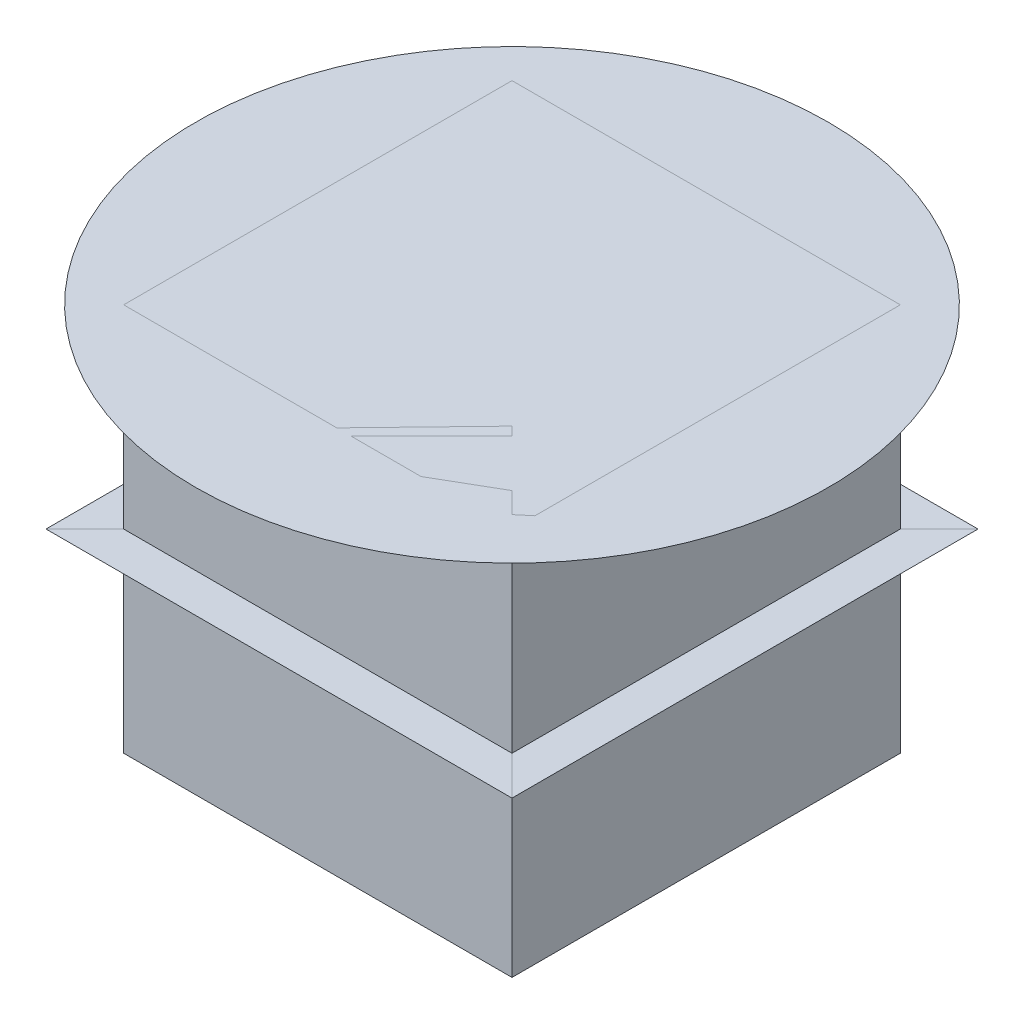
ISO-10303-21;
HEADER;
FILE_DESCRIPTION(('STEP AP214'),'2;1');
FILE_NAME('part.step','',(''),(''),'','','');
FILE_SCHEMA(('AUTOMOTIVE_DESIGN { 1 0 10303 214 1 1 1 1 }'));
ENDSEC;
DATA;
#1=APPLICATION_CONTEXT('core data for automotive mechanical design processes');
#2=APPLICATION_PROTOCOL_DEFINITION('international standard','automotive_design',2000,#1);
#3=PRODUCT_CONTEXT('',#1,'mechanical');
#4=PRODUCT('Part','Part','',(#3));
#5=PRODUCT_RELATED_PRODUCT_CATEGORY('part','',(#4));
#6=PRODUCT_DEFINITION_FORMATION('','',#4);
#7=PRODUCT_DEFINITION_CONTEXT('part definition',#1,'design');
#8=PRODUCT_DEFINITION('design','',#6,#7);
#9=PRODUCT_DEFINITION_SHAPE('','',#8);
#10=(LENGTH_UNIT() NAMED_UNIT(*) SI_UNIT(.MILLI.,.METRE.));
#11=(NAMED_UNIT(*) PLANE_ANGLE_UNIT() SI_UNIT($,.RADIAN.));
#12=(NAMED_UNIT(*) SI_UNIT($,.STERADIAN.) SOLID_ANGLE_UNIT());
#13=UNCERTAINTY_MEASURE_WITH_UNIT(LENGTH_MEASURE(1.E-05),#10,'distance_accuracy_value','');
#14=(GEOMETRIC_REPRESENTATION_CONTEXT(3) GLOBAL_UNCERTAINTY_ASSIGNED_CONTEXT((#13)) GLOBAL_UNIT_ASSIGNED_CONTEXT((#10,
#11,#12)) REPRESENTATION_CONTEXT('',''));
#15=CARTESIAN_POINT('',(0.,0.,0.));
#16=DIRECTION('',(0.,0.,1.));
#17=DIRECTION('',(1.,0.,0.));
#18=AXIS2_PLACEMENT_3D('',#15,#16,#17);
#19=CARTESIAN_POINT('',(0.,50.,0.));
#20=DIRECTION('',(0.,1.,0.));
#21=DIRECTION('',(0.,0.,1.));
#22=AXIS2_PLACEMENT_3D('',#19,#20,#21);
#23=PLANE('',#22);
#24=CARTESIAN_POINT('',(0.,50.,0.));
#25=DIRECTION('',(0.,1.,0.));
#26=DIRECTION('',(0.,0.,1.));
#27=AXIS2_PLACEMENT_3D('',#24,#25,#26);
#28=CIRCLE('',#27,81.467474192056);
#29=CARTESIAN_POINT('',(0.,50.,81.467474192056));
#30=VERTEX_POINT('',#29);
#31=EDGE_CURVE('E13',#30,#30,#28,.T.);
#32=ORIENTED_EDGE('',*,*,#31,.T.);
#33=EDGE_LOOP('',(#32));
#34=FACE_BOUND('',#33,.T.);
#35=ADVANCED_FACE('F53',(#34),#23,.T.);
#36=OPEN_SHELL('',(#35));
#37=SHELL_BASED_SURFACE_MODEL('B2',(#36));
#38=CARTESIAN_POINT('',(0.,0.,0.));
#39=DIRECTION('',(0.,1.,0.));
#40=DIRECTION('',(0.,0.,1.));
#41=AXIS2_PLACEMENT_3D('',#38,#39,#40);
#42=PLANE('',#41);
#43=DIRECTION('',(1.,0.,0.));
#44=VECTOR('',#43,1.);
#45=CARTESIAN_POINT('',(-60.,0.,60.));
#46=LINE('',#45,#44);
#47=CARTESIAN_POINT('',(-60.,0.,60.));
#48=VERTEX_POINT('',#47);
#49=CARTESIAN_POINT('',(60.,0.,60.));
#50=VERTEX_POINT('',#49);
#51=EDGE_CURVE('E86',#48,#50,#46,.T.);
#52=ORIENTED_EDGE('',*,*,#51,.T.);
#53=DIRECTION('',(-0.707106781186548,0.,-0.707106781186547));
#54=VECTOR('',#53,1.);
#55=CARTESIAN_POINT('',(60.,0.,60.));
#56=LINE('',#55,#54);
#57=CARTESIAN_POINT('',(50.,0.,50.));
#58=VERTEX_POINT('',#57);
#59=EDGE_CURVE('E51',#50,#58,#56,.T.);
#60=ORIENTED_EDGE('',*,*,#59,.T.);
#61=DIRECTION('',(-1.,0.,0.));
#62=VECTOR('',#61,1.);
#63=CARTESIAN_POINT('',(-50.,0.,50.));
#64=LINE('',#63,#62);
#65=CARTESIAN_POINT('',(-50.,0.,50.));
#66=VERTEX_POINT('',#65);
#67=EDGE_CURVE('E80',#58,#66,#64,.T.);
#68=ORIENTED_EDGE('',*,*,#67,.T.);
#69=DIRECTION('',(-0.707106781186548,0.,0.707106781186548));
#70=VECTOR('',#69,1.);
#71=CARTESIAN_POINT('',(-50.,0.,50.));
#72=LINE('',#71,#70);
#73=EDGE_CURVE('E100',#66,#48,#72,.T.);
#74=ORIENTED_EDGE('',*,*,#73,.T.);
#75=EDGE_LOOP('',(#52,#60,#68,#74));
#76=FACE_BOUND('',#75,.T.);
#77=ADVANCED_FACE('F79',(#76),#42,.T.);
#78=OPEN_SHELL('',(#77));
#79=SHELL_BASED_SURFACE_MODEL('B8',(#78));
#80=CARTESIAN_POINT('',(0.,0.,0.));
#81=DIRECTION('',(0.,1.,0.));
#82=DIRECTION('',(0.,0.,1.));
#83=AXIS2_PLACEMENT_3D('',#80,#81,#82);
#84=PLANE('',#83);
#85=DIRECTION('',(0.,0.,-1.));
#86=VECTOR('',#85,1.);
#87=CARTESIAN_POINT('',(60.,0.,60.));
#88=LINE('',#87,#86);
#89=CARTESIAN_POINT('',(60.,0.,60.));
#90=VERTEX_POINT('',#89);
#91=CARTESIAN_POINT('',(60.,0.,-60.));
#92=VERTEX_POINT('',#91);
#93=EDGE_CURVE('E139',#90,#92,#88,.T.);
#94=ORIENTED_EDGE('',*,*,#93,.T.);
#95=DIRECTION('',(-0.707106781186547,0.,0.707106781186547));
#96=VECTOR('',#95,1.);
#97=CARTESIAN_POINT('',(60.,0.,-60.));
#98=LINE('',#97,#96);
#99=CARTESIAN_POINT('',(50.,0.,-50.));
#100=VERTEX_POINT('',#99);
#101=EDGE_CURVE('E77',#92,#100,#98,.T.);
#102=ORIENTED_EDGE('',*,*,#101,.T.);
#103=DIRECTION('',(0.,0.,1.));
#104=VECTOR('',#103,1.);
#105=CARTESIAN_POINT('',(50.,0.,-50.));
#106=LINE('',#105,#104);
#107=CARTESIAN_POINT('',(50.,0.,50.));
#108=VERTEX_POINT('',#107);
#109=EDGE_CURVE('E133',#100,#108,#106,.T.);
#110=ORIENTED_EDGE('',*,*,#109,.T.);
#111=DIRECTION('',(0.707106781186547,0.,0.707106781186548));
#112=VECTOR('',#111,1.);
#113=CARTESIAN_POINT('',(50.,0.,50.));
#114=LINE('',#113,#112);
#115=EDGE_CURVE('E153',#108,#90,#114,.T.);
#116=ORIENTED_EDGE('',*,*,#115,.T.);
#117=EDGE_LOOP('',(#94,#102,#110,#116));
#118=FACE_BOUND('',#117,.T.);
#119=ADVANCED_FACE('F132',(#118),#84,.T.);
#120=OPEN_SHELL('',(#119));
#121=SHELL_BASED_SURFACE_MODEL('B45',(#120));
#122=CARTESIAN_POINT('',(0.,0.,0.));
#123=DIRECTION('',(0.,1.,0.));
#124=DIRECTION('',(0.,0.,1.));
#125=AXIS2_PLACEMENT_3D('',#122,#123,#124);
#126=PLANE('',#125);
#127=DIRECTION('',(-1.,0.,0.));
#128=VECTOR('',#127,1.);
#129=CARTESIAN_POINT('',(60.,0.,-60.));
#130=LINE('',#129,#128);
#131=CARTESIAN_POINT('',(60.,0.,-60.));
#132=VERTEX_POINT('',#131);
#133=CARTESIAN_POINT('',(-60.,0.,-60.));
#134=VERTEX_POINT('',#133);
#135=EDGE_CURVE('E192',#132,#134,#130,.T.);
#136=ORIENTED_EDGE('',*,*,#135,.T.);
#137=DIRECTION('',(0.707106781186548,0.,0.707106781186547));
#138=VECTOR('',#137,1.);
#139=CARTESIAN_POINT('',(-60.,0.,-60.));
#140=LINE('',#139,#138);
#141=CARTESIAN_POINT('',(-50.,0.,-50.));
#142=VERTEX_POINT('',#141);
#143=EDGE_CURVE('E130',#134,#142,#140,.T.);
#144=ORIENTED_EDGE('',*,*,#143,.T.);
#145=DIRECTION('',(1.,0.,0.));
#146=VECTOR('',#145,1.);
#147=CARTESIAN_POINT('',(-50.,0.,-50.));
#148=LINE('',#147,#146);
#149=CARTESIAN_POINT('',(50.,0.,-50.));
#150=VERTEX_POINT('',#149);
#151=EDGE_CURVE('E186',#142,#150,#148,.T.);
#152=ORIENTED_EDGE('',*,*,#151,.T.);
#153=DIRECTION('',(0.707106781186547,0.,-0.707106781186548));
#154=VECTOR('',#153,1.);
#155=CARTESIAN_POINT('',(50.,0.,-50.));
#156=LINE('',#155,#154);
#157=EDGE_CURVE('E206',#150,#132,#156,.T.);
#158=ORIENTED_EDGE('',*,*,#157,.T.);
#159=EDGE_LOOP('',(#136,#144,#152,#158));
#160=FACE_BOUND('',#159,.T.);
#161=ADVANCED_FACE('F185',(#160),#126,.T.);
#162=OPEN_SHELL('',(#161));
#163=SHELL_BASED_SURFACE_MODEL('B71',(#162));
#164=CARTESIAN_POINT('',(0.,0.,0.));
#165=DIRECTION('',(0.,1.,0.));
#166=DIRECTION('',(0.,0.,1.));
#167=AXIS2_PLACEMENT_3D('',#164,#165,#166);
#168=PLANE('',#167);
#169=DIRECTION('',(0.,0.,1.));
#170=VECTOR('',#169,1.);
#171=CARTESIAN_POINT('',(-60.,0.,-60.));
#172=LINE('',#171,#170);
#173=CARTESIAN_POINT('',(-60.,0.,-60.));
#174=VERTEX_POINT('',#173);
#175=CARTESIAN_POINT('',(-60.,0.,60.));
#176=VERTEX_POINT('',#175);
#177=EDGE_CURVE('E245',#174,#176,#172,.T.);
#178=ORIENTED_EDGE('',*,*,#177,.T.);
#179=DIRECTION('',(0.707106781186548,0.,-0.707106781186548));
#180=VECTOR('',#179,1.);
#181=CARTESIAN_POINT('',(-60.,0.,60.));
#182=LINE('',#181,#180);
#183=CARTESIAN_POINT('',(-50.,0.,50.));
#184=VERTEX_POINT('',#183);
#185=EDGE_CURVE('E183',#176,#184,#182,.T.);
#186=ORIENTED_EDGE('',*,*,#185,.T.);
#187=DIRECTION('',(0.,0.,-1.));
#188=VECTOR('',#187,1.);
#189=CARTESIAN_POINT('',(-50.,0.,-50.));
#190=LINE('',#189,#188);
#191=CARTESIAN_POINT('',(-50.,0.,-50.));
#192=VERTEX_POINT('',#191);
#193=EDGE_CURVE('E239',#184,#192,#190,.T.);
#194=ORIENTED_EDGE('',*,*,#193,.T.);
#195=DIRECTION('',(-0.707106781186548,0.,-0.707106781186548));
#196=VECTOR('',#195,1.);
#197=CARTESIAN_POINT('',(-50.,0.,-50.));
#198=LINE('',#197,#196);
#199=EDGE_CURVE('E259',#192,#174,#198,.T.);
#200=ORIENTED_EDGE('',*,*,#199,.T.);
#201=EDGE_LOOP('',(#178,#186,#194,#200));
#202=FACE_BOUND('',#201,.T.);
#203=ADVANCED_FACE('F238',(#202),#168,.T.);
#204=OPEN_SHELL('',(#203));
#205=SHELL_BASED_SURFACE_MODEL('B124',(#204));
#206=CARTESIAN_POINT('',(0.,0.,0.));
#207=DIRECTION('',(0.,1.,0.));
#208=DIRECTION('',(0.,0.,1.));
#209=AXIS2_PLACEMENT_3D('',#206,#207,#208);
#210=PLANE('',#209);
#211=DIRECTION('',(0.,0.,-1.));
#212=VECTOR('',#211,1.);
#213=CARTESIAN_POINT('',(50.,0.,-50.));
#214=LINE('',#213,#212);
#215=CARTESIAN_POINT('',(50.,0.,50.));
#216=VERTEX_POINT('',#215);
#217=CARTESIAN_POINT('',(50.,0.,-50.));
#218=VERTEX_POINT('',#217);
#219=EDGE_CURVE('E299',#216,#218,#214,.T.);
#220=ORIENTED_EDGE('',*,*,#219,.T.);
#221=DIRECTION('',(-1.,0.,0.));
#222=VECTOR('',#221,1.);
#223=CARTESIAN_POINT('',(-50.,0.,-50.));
#224=LINE('',#223,#222);
#225=CARTESIAN_POINT('',(-50.,0.,-50.));
#226=VERTEX_POINT('',#225);
#227=EDGE_CURVE('E310',#218,#226,#224,.T.);
#228=ORIENTED_EDGE('',*,*,#227,.T.);
#229=DIRECTION('',(0.,0.,1.));
#230=VECTOR('',#229,1.);
#231=CARTESIAN_POINT('',(-50.,0.,-50.));
#232=LINE('',#231,#230);
#233=CARTESIAN_POINT('',(-50.,0.,50.));
#234=VERTEX_POINT('',#233);
#235=EDGE_CURVE('E295',#226,#234,#232,.T.);
#236=ORIENTED_EDGE('',*,*,#235,.T.);
#237=DIRECTION('',(1.,0.,0.));
#238=VECTOR('',#237,1.);
#239=CARTESIAN_POINT('',(-50.,0.,50.));
#240=LINE('',#239,#238);
#241=EDGE_CURVE('E236',#234,#216,#240,.T.);
#242=ORIENTED_EDGE('',*,*,#241,.T.);
#243=EDGE_LOOP('',(#220,#228,#236,#242));
#244=FACE_BOUND('',#243,.T.);
#245=ADVANCED_FACE('F290',(#244),#210,.T.);
#246=OPEN_SHELL('',(#245));
#247=SHELL_BASED_SURFACE_MODEL('B177',(#246));
#248=CARTESIAN_POINT('',(50.,50.,-50.));
#249=DIRECTION('',(-1.,0.,0.));
#250=DIRECTION('',(0.,0.,1.));
#251=AXIS2_PLACEMENT_3D('',#248,#249,#250);
#252=PLANE('',#251);
#253=DIRECTION('',(0.,0.,-1.));
#254=VECTOR('',#253,1.);
#255=CARTESIAN_POINT('',(50.,-50.,-50.));
#256=LINE('',#255,#254);
#257=CARTESIAN_POINT('',(50.,-50.,50.));
#258=VERTEX_POINT('',#257);
#259=CARTESIAN_POINT('',(50.,-50.,-50.));
#260=VERTEX_POINT('',#259);
#261=EDGE_CURVE('E396',#258,#260,#256,.T.);
#262=ORIENTED_EDGE('',*,*,#261,.T.);
#263=DIRECTION('',(0.,-1.,0.));
#264=VECTOR('',#263,1.);
#265=CARTESIAN_POINT('',(50.,50.,-50.));
#266=LINE('',#265,#264);
#267=CARTESIAN_POINT('',(50.,50.,-50.));
#268=VERTEX_POINT('',#267);
#269=EDGE_CURVE('E288',#268,#260,#266,.T.);
#270=ORIENTED_EDGE('',*,*,#269,.F.);
#271=DIRECTION('',(0.,0.,-1.));
#272=VECTOR('',#271,1.);
#273=CARTESIAN_POINT('',(50.,50.,-50.));
#274=LINE('',#273,#272);
#275=CARTESIAN_POINT('',(50.,50.,50.));
#276=VERTEX_POINT('',#275);
#277=EDGE_CURVE('E384',#276,#268,#274,.T.);
#278=ORIENTED_EDGE('',*,*,#277,.F.);
#279=DIRECTION('',(0.,-1.,0.));
#280=VECTOR('',#279,1.);
#281=CARTESIAN_POINT('',(50.,50.,50.));
#282=LINE('',#281,#280);
#283=EDGE_CURVE('E392',#276,#258,#282,.T.);
#284=ORIENTED_EDGE('',*,*,#283,.T.);
#285=EDGE_LOOP('',(#262,#270,#278,#284));
#286=FACE_BOUND('',#285,.T.);
#287=ADVANCED_FACE('F333',(#286),#252,.F.);
#288=CARTESIAN_POINT('',(-50.,50.,-50.));
#289=DIRECTION('',(0.,0.,1.));
#290=DIRECTION('',(1.,0.,0.));
#291=AXIS2_PLACEMENT_3D('',#288,#289,#290);
#292=PLANE('',#291);
#293=DIRECTION('',(-1.,0.,0.));
#294=VECTOR('',#293,1.);
#295=CARTESIAN_POINT('',(-50.,-50.,-50.));
#296=LINE('',#295,#294);
#297=CARTESIAN_POINT('',(-50.,-50.,-50.));
#298=VERTEX_POINT('',#297);
#299=EDGE_CURVE('E388',#260,#298,#296,.T.);
#300=ORIENTED_EDGE('',*,*,#299,.T.);
#301=DIRECTION('',(0.,-1.,0.));
#302=VECTOR('',#301,1.);
#303=CARTESIAN_POINT('',(-50.,50.,-50.));
#304=LINE('',#303,#302);
#305=CARTESIAN_POINT('',(-50.,50.,-50.));
#306=VERTEX_POINT('',#305);
#307=EDGE_CURVE('E341',#306,#298,#304,.T.);
#308=ORIENTED_EDGE('',*,*,#307,.F.);
#309=DIRECTION('',(-1.,0.,0.));
#310=VECTOR('',#309,1.);
#311=CARTESIAN_POINT('',(-50.,50.,-50.));
#312=LINE('',#311,#310);
#313=EDGE_CURVE('E379',#268,#306,#312,.T.);
#314=ORIENTED_EDGE('',*,*,#313,.F.);
#315=ORIENTED_EDGE('',*,*,#269,.T.);
#316=EDGE_LOOP('',(#300,#308,#314,#315));
#317=FACE_BOUND('',#316,.T.);
#318=ADVANCED_FACE('F387',(#317),#292,.F.);
#319=CARTESIAN_POINT('',(-50.,50.,-50.));
#320=DIRECTION('',(1.,0.,0.));
#321=DIRECTION('',(0.,0.,-1.));
#322=AXIS2_PLACEMENT_3D('',#319,#320,#321);
#323=PLANE('',#322);
#324=DIRECTION('',(0.,0.,1.));
#325=VECTOR('',#324,1.);
#326=CARTESIAN_POINT('',(-50.,-50.,-50.));
#327=LINE('',#326,#325);
#328=CARTESIAN_POINT('',(-50.,-50.,50.));
#329=VERTEX_POINT('',#328);
#330=EDGE_CURVE('E366',#298,#329,#327,.T.);
#331=ORIENTED_EDGE('',*,*,#330,.T.);
#332=DIRECTION('',(0.,-1.,0.));
#333=VECTOR('',#332,1.);
#334=CARTESIAN_POINT('',(-50.,50.,50.));
#335=LINE('',#334,#333);
#336=CARTESIAN_POINT('',(-50.,50.,50.));
#337=VERTEX_POINT('',#336);
#338=EDGE_CURVE('E389',#337,#329,#335,.T.);
#339=ORIENTED_EDGE('',*,*,#338,.F.);
#340=DIRECTION('',(0.,0.,1.));
#341=VECTOR('',#340,1.);
#342=CARTESIAN_POINT('',(-50.,50.,-50.));
#343=LINE('',#342,#341);
#344=EDGE_CURVE('E382',#306,#337,#343,.T.);
#345=ORIENTED_EDGE('',*,*,#344,.F.);
#346=ORIENTED_EDGE('',*,*,#307,.T.);
#347=EDGE_LOOP('',(#331,#339,#345,#346));
#348=FACE_BOUND('',#347,.T.);
#349=ADVANCED_FACE('F390',(#348),#323,.F.);
#350=CARTESIAN_POINT('',(-50.,50.,50.));
#351=DIRECTION('',(0.,0.,-1.));
#352=DIRECTION('',(-1.,0.,0.));
#353=AXIS2_PLACEMENT_3D('',#350,#351,#352);
#354=PLANE('',#353);
#355=DIRECTION('',(1.,0.,0.));
#356=VECTOR('',#355,1.);
#357=CARTESIAN_POINT('',(-50.,-50.,50.));
#358=LINE('',#357,#356);
#359=EDGE_CURVE('E372',#329,#258,#358,.T.);
#360=ORIENTED_EDGE('',*,*,#359,.T.);
#361=ORIENTED_EDGE('',*,*,#283,.F.);
#362=DIRECTION('',(1.,0.,0.));
#363=VECTOR('',#362,1.);
#364=CARTESIAN_POINT('',(-50.,50.,50.));
#365=LINE('',#364,#363);
#366=EDGE_CURVE('E349',#337,#276,#365,.T.);
#367=ORIENTED_EDGE('',*,*,#366,.F.);
#368=ORIENTED_EDGE('',*,*,#338,.T.);
#369=EDGE_LOOP('',(#360,#361,#367,#368));
#370=FACE_BOUND('',#369,.T.);
#371=ADVANCED_FACE('F403',(#370),#354,.F.);
#372=CARTESIAN_POINT('',(0.,50.,0.));
#373=DIRECTION('',(0.,1.,0.));
#374=DIRECTION('',(0.,0.,1.));
#375=AXIS2_PLACEMENT_3D('',#372,#373,#374);
#376=PLANE('',#375);
#377=ORIENTED_EDGE('',*,*,#277,.T.);
#378=ORIENTED_EDGE('',*,*,#313,.T.);
#379=ORIENTED_EDGE('',*,*,#344,.T.);
#380=ORIENTED_EDGE('',*,*,#366,.T.);
#381=EDGE_LOOP('',(#377,#378,#379,#380));
#382=FACE_BOUND('',#381,.T.);
#383=ADVANCED_FACE('F380',(#382),#376,.T.);
#384=CARTESIAN_POINT('',(0.,-50.,0.));
#385=DIRECTION('',(0.,1.,0.));
#386=DIRECTION('',(0.,0.,1.));
#387=AXIS2_PLACEMENT_3D('',#384,#385,#386);
#388=PLANE('',#387);
#389=ORIENTED_EDGE('',*,*,#261,.F.);
#390=ORIENTED_EDGE('',*,*,#359,.F.);
#391=ORIENTED_EDGE('',*,*,#330,.F.);
#392=ORIENTED_EDGE('',*,*,#299,.F.);
#393=EDGE_LOOP('',(#389,#390,#391,#392));
#394=FACE_BOUND('',#393,.T.);
#395=ADVANCED_FACE('F406',(#394),#388,.F.);
#396=CLOSED_SHELL('',(#287,#318,#349,#371,#383,#395));
#397=MANIFOLD_SOLID_BREP('B230',#396);
#398=ADVANCED_BREP_SHAPE_REPRESENTATION('',(#18,#397),#14);
#399=MANIFOLD_SURFACE_SHAPE_REPRESENTATION('',(#18,#37,#79,#121,#163,#205,#247),#14);
#400=SHAPE_REPRESENTATION('',(#18),#14);
#401=SHAPE_DEFINITION_REPRESENTATION(#9,#400);
#402=SHAPE_REPRESENTATION_RELATIONSHIP('','',#400,#398);
#403=SHAPE_REPRESENTATION_RELATIONSHIP('','',#400,#399);
ENDSEC;
END-ISO-10303-21;
